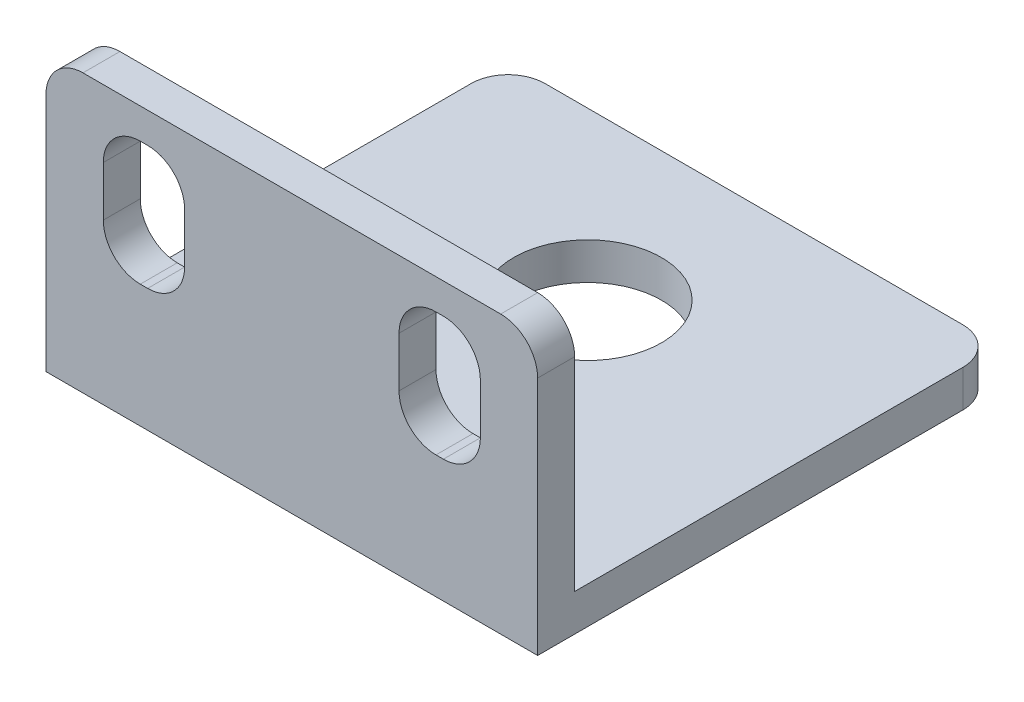
ISO-10303-21;
HEADER;
FILE_DESCRIPTION(('STEP AP214'),'2;1');
FILE_NAME('part.step','',(''),(''),'','','');
FILE_SCHEMA(('AUTOMOTIVE_DESIGN { 1 0 10303 214 1 1 1 1 }'));
ENDSEC;
DATA;
#1=APPLICATION_CONTEXT('core data for automotive mechanical design processes');
#2=APPLICATION_PROTOCOL_DEFINITION('international standard','automotive_design',2000,#1);
#3=PRODUCT_CONTEXT('',#1,'mechanical');
#4=PRODUCT('Part','Part','',(#3));
#5=PRODUCT_RELATED_PRODUCT_CATEGORY('part','',(#4));
#6=PRODUCT_DEFINITION_FORMATION('','',#4);
#7=PRODUCT_DEFINITION_CONTEXT('part definition',#1,'design');
#8=PRODUCT_DEFINITION('design','',#6,#7);
#9=PRODUCT_DEFINITION_SHAPE('','',#8);
#10=(LENGTH_UNIT() NAMED_UNIT(*) SI_UNIT(.MILLI.,.METRE.));
#11=(NAMED_UNIT(*) PLANE_ANGLE_UNIT() SI_UNIT($,.RADIAN.));
#12=(NAMED_UNIT(*) SI_UNIT($,.STERADIAN.) SOLID_ANGLE_UNIT());
#13=UNCERTAINTY_MEASURE_WITH_UNIT(LENGTH_MEASURE(1.E-05),#10,'distance_accuracy_value','');
#14=(GEOMETRIC_REPRESENTATION_CONTEXT(3) GLOBAL_UNCERTAINTY_ASSIGNED_CONTEXT((#13)) GLOBAL_UNIT_ASSIGNED_CONTEXT((#10,
#11,#12)) REPRESENTATION_CONTEXT('',''));
#15=CARTESIAN_POINT('',(0.,0.,0.));
#16=DIRECTION('',(0.,0.,1.));
#17=DIRECTION('',(1.,0.,0.));
#18=AXIS2_PLACEMENT_3D('',#15,#16,#17);
#19=CARTESIAN_POINT('',(-13.3,2.,12.5));
#20=DIRECTION('',(1.,0.,0.));
#21=DIRECTION('',(0.,0.,-1.));
#22=AXIS2_PLACEMENT_3D('',#19,#20,#21);
#23=PLANE('',#22);
#24=DIRECTION('',(0.,0.,1.));
#25=VECTOR('',#24,1.);
#26=CARTESIAN_POINT('',(-13.3,2.,12.5));
#27=LINE('',#26,#25);
#28=CARTESIAN_POINT('',(-13.3,2.,-10.5));
#29=VERTEX_POINT('',#28);
#30=CARTESIAN_POINT('',(-13.3,2.,10.5));
#31=VERTEX_POINT('',#30);
#32=EDGE_CURVE('E209',#29,#31,#27,.T.);
#33=ORIENTED_EDGE('',*,*,#32,.F.);
#34=DIRECTION('',(0.,-1.,0.));
#35=VECTOR('',#34,1.);
#36=CARTESIAN_POINT('',(-13.3,2.,-10.5));
#37=LINE('',#36,#35);
#38=CARTESIAN_POINT('',(-13.3,0.,-10.5));
#39=VERTEX_POINT('',#38);
#40=EDGE_CURVE('E257',#29,#39,#37,.T.);
#41=ORIENTED_EDGE('',*,*,#40,.T.);
#42=DIRECTION('',(0.,0.,1.));
#43=VECTOR('',#42,1.);
#44=CARTESIAN_POINT('',(-13.3,0.,12.5));
#45=LINE('',#44,#43);
#46=CARTESIAN_POINT('',(-13.3,0.,12.5));
#47=VERTEX_POINT('',#46);
#48=EDGE_CURVE('E274',#39,#47,#45,.T.);
#49=ORIENTED_EDGE('',*,*,#48,.T.);
#50=DIRECTION('',(0.,-1.,0.));
#51=VECTOR('',#50,1.);
#52=CARTESIAN_POINT('',(-13.3,2.,12.5));
#53=LINE('',#52,#51);
#54=CARTESIAN_POINT('',(-13.3,13.,12.5));
#55=VERTEX_POINT('',#54);
#56=EDGE_CURVE('E258',#55,#47,#53,.T.);
#57=ORIENTED_EDGE('',*,*,#56,.F.);
#58=DIRECTION('',(0.,0.,1.));
#59=VECTOR('',#58,1.);
#60=CARTESIAN_POINT('',(-13.3,13.,12.5));
#61=LINE('',#60,#59);
#62=CARTESIAN_POINT('',(-13.3,13.,10.5));
#63=VERTEX_POINT('',#62);
#64=EDGE_CURVE('E228',#55,#63,#61,.F.);
#65=ORIENTED_EDGE('',*,*,#64,.T.);
#66=DIRECTION('',(0.,-1.,0.));
#67=VECTOR('',#66,1.);
#68=CARTESIAN_POINT('',(-13.3,15.,10.5));
#69=LINE('',#68,#67);
#70=EDGE_CURVE('E225',#63,#31,#69,.T.);
#71=ORIENTED_EDGE('',*,*,#70,.T.);
#72=EDGE_LOOP('',(#33,#41,#49,#57,#65,#71));
#73=FACE_BOUND('',#72,.T.);
#74=ADVANCED_FACE('F34',(#73),#23,.F.);
#75=CARTESIAN_POINT('',(13.3,2.,12.5));
#76=DIRECTION('',(0.,0.,-1.));
#77=DIRECTION('',(-1.,0.,0.));
#78=AXIS2_PLACEMENT_3D('',#75,#76,#77);
#79=PLANE('',#78);
#80=DIRECTION('',(0.,-1.,0.));
#81=VECTOR('',#80,1.);
#82=CARTESIAN_POINT('',(-5.8,6.65,12.5));
#83=LINE('',#82,#81);
#84=CARTESIAN_POINT('',(-5.8,11.35,12.5));
#85=VERTEX_POINT('',#84);
#86=CARTESIAN_POINT('',(-5.8,8.65,12.5));
#87=VERTEX_POINT('',#86);
#88=EDGE_CURVE('E420',#85,#87,#83,.T.);
#89=ORIENTED_EDGE('',*,*,#88,.T.);
#90=CARTESIAN_POINT('',(-7.8,8.65,12.5));
#91=DIRECTION('',(0.,0.,-1.));
#92=DIRECTION('',(-1.,0.,0.));
#93=AXIS2_PLACEMENT_3D('',#90,#91,#92);
#94=CIRCLE('',#93,2.);
#95=CARTESIAN_POINT('',(-7.8,6.65,12.5));
#96=VERTEX_POINT('',#95);
#97=EDGE_CURVE('E344',#87,#96,#94,.T.);
#98=ORIENTED_EDGE('',*,*,#97,.T.);
#99=DIRECTION('',(-1.,0.,0.));
#100=VECTOR('',#99,1.);
#101=CARTESIAN_POINT('',(-5.8,6.65,12.5));
#102=LINE('',#101,#100);
#103=CARTESIAN_POINT('',(-8.2,6.65,12.5));
#104=VERTEX_POINT('',#103);
#105=EDGE_CURVE('E392',#96,#104,#102,.T.);
#106=ORIENTED_EDGE('',*,*,#105,.T.);
#107=CARTESIAN_POINT('',(-8.2,8.65,12.5));
#108=DIRECTION('',(0.,0.,-1.));
#109=DIRECTION('',(-1.,0.,0.));
#110=AXIS2_PLACEMENT_3D('',#107,#108,#109);
#111=CIRCLE('',#110,2.);
#112=CARTESIAN_POINT('',(-10.2,8.65,12.5));
#113=VERTEX_POINT('',#112);
#114=EDGE_CURVE('E340',#104,#113,#111,.T.);
#115=ORIENTED_EDGE('',*,*,#114,.T.);
#116=DIRECTION('',(0.,1.,0.));
#117=VECTOR('',#116,1.);
#118=CARTESIAN_POINT('',(-10.2,6.65,12.5));
#119=LINE('',#118,#117);
#120=CARTESIAN_POINT('',(-10.2,11.35,12.5));
#121=VERTEX_POINT('',#120);
#122=EDGE_CURVE('E407',#113,#121,#119,.T.);
#123=ORIENTED_EDGE('',*,*,#122,.T.);
#124=CARTESIAN_POINT('',(-8.2,11.35,12.5));
#125=DIRECTION('',(0.,0.,-1.));
#126=DIRECTION('',(-1.,0.,0.));
#127=AXIS2_PLACEMENT_3D('',#124,#125,#126);
#128=CIRCLE('',#127,2.);
#129=CARTESIAN_POINT('',(-8.2,13.35,12.5));
#130=VERTEX_POINT('',#129);
#131=EDGE_CURVE('E348',#121,#130,#128,.T.);
#132=ORIENTED_EDGE('',*,*,#131,.T.);
#133=DIRECTION('',(1.,0.,0.));
#134=VECTOR('',#133,1.);
#135=CARTESIAN_POINT('',(-5.8,13.35,12.5));
#136=LINE('',#135,#134);
#137=CARTESIAN_POINT('',(-7.8,13.35,12.5));
#138=VERTEX_POINT('',#137);
#139=EDGE_CURVE('E423',#130,#138,#136,.T.);
#140=ORIENTED_EDGE('',*,*,#139,.T.);
#141=CARTESIAN_POINT('',(-7.8,11.35,12.5));
#142=DIRECTION('',(0.,0.,-1.));
#143=DIRECTION('',(-1.,0.,0.));
#144=AXIS2_PLACEMENT_3D('',#141,#142,#143);
#145=CIRCLE('',#144,2.);
#146=EDGE_CURVE('E352',#138,#85,#145,.T.);
#147=ORIENTED_EDGE('',*,*,#146,.T.);
#148=EDGE_LOOP('',(#89,#98,#106,#115,#123,#132,#140,#147));
#149=FACE_BOUND('',#148,.T.);
#150=DIRECTION('',(0.,-1.,0.));
#151=VECTOR('',#150,1.);
#152=CARTESIAN_POINT('',(10.2,6.65,12.5));
#153=LINE('',#152,#151);
#154=CARTESIAN_POINT('',(10.2,11.35,12.5));
#155=VERTEX_POINT('',#154);
#156=CARTESIAN_POINT('',(10.2,8.65,12.5));
#157=VERTEX_POINT('',#156);
#158=EDGE_CURVE('E240',#155,#157,#153,.T.);
#159=ORIENTED_EDGE('',*,*,#158,.T.);
#160=CARTESIAN_POINT('',(8.2,8.65,12.5));
#161=DIRECTION('',(0.,0.,-1.));
#162=DIRECTION('',(-1.,0.,0.));
#163=AXIS2_PLACEMENT_3D('',#160,#161,#162);
#164=CIRCLE('',#163,2.);
#165=CARTESIAN_POINT('',(8.2,6.65,12.5));
#166=VERTEX_POINT('',#165);
#167=EDGE_CURVE('E336',#157,#166,#164,.T.);
#168=ORIENTED_EDGE('',*,*,#167,.T.);
#169=DIRECTION('',(-1.,0.,0.));
#170=VECTOR('',#169,1.);
#171=CARTESIAN_POINT('',(10.2,6.65,12.5));
#172=LINE('',#171,#170);
#173=CARTESIAN_POINT('',(7.8,6.65,12.5));
#174=VERTEX_POINT('',#173);
#175=EDGE_CURVE('E235',#166,#174,#172,.T.);
#176=ORIENTED_EDGE('',*,*,#175,.T.);
#177=CARTESIAN_POINT('',(7.8,8.65,12.5));
#178=DIRECTION('',(0.,0.,-1.));
#179=DIRECTION('',(-1.,0.,0.));
#180=AXIS2_PLACEMENT_3D('',#177,#178,#179);
#181=CIRCLE('',#180,2.);
#182=CARTESIAN_POINT('',(5.8,8.65,12.5));
#183=VERTEX_POINT('',#182);
#184=EDGE_CURVE('E332',#174,#183,#181,.T.);
#185=ORIENTED_EDGE('',*,*,#184,.T.);
#186=DIRECTION('',(0.,1.,0.));
#187=VECTOR('',#186,1.);
#188=CARTESIAN_POINT('',(5.8,6.65,12.5));
#189=LINE('',#188,#187);
#190=CARTESIAN_POINT('',(5.8,11.35,12.5));
#191=VERTEX_POINT('',#190);
#192=EDGE_CURVE('E387',#183,#191,#189,.T.);
#193=ORIENTED_EDGE('',*,*,#192,.T.);
#194=CARTESIAN_POINT('',(7.8,11.35,12.5));
#195=DIRECTION('',(0.,0.,-1.));
#196=DIRECTION('',(-1.,0.,0.));
#197=AXIS2_PLACEMENT_3D('',#194,#195,#196);
#198=CIRCLE('',#197,2.);
#199=CARTESIAN_POINT('',(7.8,13.35,12.5));
#200=VERTEX_POINT('',#199);
#201=EDGE_CURVE('E356',#191,#200,#198,.T.);
#202=ORIENTED_EDGE('',*,*,#201,.T.);
#203=DIRECTION('',(1.,0.,0.));
#204=VECTOR('',#203,1.);
#205=CARTESIAN_POINT('',(10.2,13.35,12.5));
#206=LINE('',#205,#204);
#207=CARTESIAN_POINT('',(8.2,13.35,12.5));
#208=VERTEX_POINT('',#207);
#209=EDGE_CURVE('E382',#200,#208,#206,.T.);
#210=ORIENTED_EDGE('',*,*,#209,.T.);
#211=CARTESIAN_POINT('',(8.2,11.35,12.5));
#212=DIRECTION('',(0.,0.,-1.));
#213=DIRECTION('',(-1.,0.,0.));
#214=AXIS2_PLACEMENT_3D('',#211,#212,#213);
#215=CIRCLE('',#214,2.);
#216=EDGE_CURVE('E11',#208,#155,#215,.T.);
#217=ORIENTED_EDGE('',*,*,#216,.T.);
#218=EDGE_LOOP('',(#159,#168,#176,#185,#193,#202,#210,#217));
#219=FACE_BOUND('',#218,.T.);
#220=DIRECTION('',(0.,-1.,0.));
#221=VECTOR('',#220,1.);
#222=CARTESIAN_POINT('',(13.3,2.,12.5));
#223=LINE('',#222,#221);
#224=CARTESIAN_POINT('',(13.3,13.,12.5));
#225=VERTEX_POINT('',#224);
#226=CARTESIAN_POINT('',(13.3,0.,12.5));
#227=VERTEX_POINT('',#226);
#228=EDGE_CURVE('E513',#225,#227,#223,.T.);
#229=ORIENTED_EDGE('',*,*,#228,.F.);
#230=CARTESIAN_POINT('',(11.3,13.,12.5));
#231=DIRECTION('',(0.,0.,-1.));
#232=DIRECTION('',(-1.,0.,0.));
#233=AXIS2_PLACEMENT_3D('',#230,#231,#232);
#234=CIRCLE('',#233,2.);
#235=CARTESIAN_POINT('',(11.3,15.,12.5));
#236=VERTEX_POINT('',#235);
#237=EDGE_CURVE('E328',#225,#236,#234,.F.);
#238=ORIENTED_EDGE('',*,*,#237,.T.);
#239=DIRECTION('',(1.,0.,0.));
#240=VECTOR('',#239,1.);
#241=CARTESIAN_POINT('',(-13.3,15.,12.5));
#242=LINE('',#241,#240);
#243=CARTESIAN_POINT('',(-11.3,15.,12.5));
#244=VERTEX_POINT('',#243);
#245=EDGE_CURVE('E234',#244,#236,#242,.T.);
#246=ORIENTED_EDGE('',*,*,#245,.F.);
#247=CARTESIAN_POINT('',(-11.3,13.,12.5));
#248=DIRECTION('',(0.,0.,-1.));
#249=DIRECTION('',(-1.,0.,0.));
#250=AXIS2_PLACEMENT_3D('',#247,#248,#249);
#251=CIRCLE('',#250,2.);
#252=EDGE_CURVE('E326',#244,#55,#251,.F.);
#253=ORIENTED_EDGE('',*,*,#252,.T.);
#254=ORIENTED_EDGE('',*,*,#56,.T.);
#255=DIRECTION('',(1.,0.,0.));
#256=VECTOR('',#255,1.);
#257=CARTESIAN_POINT('',(13.3,0.,12.5));
#258=LINE('',#257,#256);
#259=EDGE_CURVE('E528',#47,#227,#258,.T.);
#260=ORIENTED_EDGE('',*,*,#259,.T.);
#261=EDGE_LOOP('',(#229,#238,#246,#253,#254,#260));
#262=FACE_BOUND('',#261,.T.);
#263=ADVANCED_FACE('F379',(#149,#219,#262),#79,.F.);
#264=CARTESIAN_POINT('',(13.3,2.,12.5));
#265=DIRECTION('',(-1.,0.,0.));
#266=DIRECTION('',(0.,0.,1.));
#267=AXIS2_PLACEMENT_3D('',#264,#265,#266);
#268=PLANE('',#267);
#269=DIRECTION('',(0.,0.,-1.));
#270=VECTOR('',#269,1.);
#271=CARTESIAN_POINT('',(13.3,0.,12.5));
#272=LINE('',#271,#270);
#273=CARTESIAN_POINT('',(13.3,0.,-10.5));
#274=VERTEX_POINT('',#273);
#275=EDGE_CURVE('E525',#227,#274,#272,.T.);
#276=ORIENTED_EDGE('',*,*,#275,.T.);
#277=DIRECTION('',(0.,-1.,0.));
#278=VECTOR('',#277,1.);
#279=CARTESIAN_POINT('',(13.3,2.,-10.5));
#280=LINE('',#279,#278);
#281=CARTESIAN_POINT('',(13.3,2.,-10.5));
#282=VERTEX_POINT('',#281);
#283=EDGE_CURVE('E277',#274,#282,#280,.F.);
#284=ORIENTED_EDGE('',*,*,#283,.T.);
#285=DIRECTION('',(0.,0.,-1.));
#286=VECTOR('',#285,1.);
#287=CARTESIAN_POINT('',(13.3,2.,12.5));
#288=LINE('',#287,#286);
#289=CARTESIAN_POINT('',(13.3,2.,10.5));
#290=VERTEX_POINT('',#289);
#291=EDGE_CURVE('E222',#290,#282,#288,.T.);
#292=ORIENTED_EDGE('',*,*,#291,.F.);
#293=DIRECTION('',(0.,-1.,0.));
#294=VECTOR('',#293,1.);
#295=CARTESIAN_POINT('',(13.3,15.,10.5));
#296=LINE('',#295,#294);
#297=CARTESIAN_POINT('',(13.3,13.,10.5));
#298=VERTEX_POINT('',#297);
#299=EDGE_CURVE('E229',#298,#290,#296,.T.);
#300=ORIENTED_EDGE('',*,*,#299,.F.);
#301=DIRECTION('',(0.,0.,-1.));
#302=VECTOR('',#301,1.);
#303=CARTESIAN_POINT('',(13.3,13.,12.5));
#304=LINE('',#303,#302);
#305=EDGE_CURVE('E272',#298,#225,#304,.F.);
#306=ORIENTED_EDGE('',*,*,#305,.T.);
#307=ORIENTED_EDGE('',*,*,#228,.T.);
#308=EDGE_LOOP('',(#276,#284,#292,#300,#306,#307));
#309=FACE_BOUND('',#308,.T.);
#310=ADVANCED_FACE('F452',(#309),#268,.F.);
#311=CARTESIAN_POINT('',(13.3,2.,-12.5));
#312=DIRECTION('',(0.,0.,1.));
#313=DIRECTION('',(1.,0.,0.));
#314=AXIS2_PLACEMENT_3D('',#311,#312,#313);
#315=PLANE('',#314);
#316=DIRECTION('',(-1.,0.,0.));
#317=VECTOR('',#316,1.);
#318=CARTESIAN_POINT('',(13.3,0.,-12.5));
#319=LINE('',#318,#317);
#320=CARTESIAN_POINT('',(11.3,0.,-12.5));
#321=VERTEX_POINT('',#320);
#322=CARTESIAN_POINT('',(-11.3,0.,-12.5));
#323=VERTEX_POINT('',#322);
#324=EDGE_CURVE('E223',#321,#323,#319,.T.);
#325=ORIENTED_EDGE('',*,*,#324,.T.);
#326=DIRECTION('',(0.,-1.,0.));
#327=VECTOR('',#326,1.);
#328=CARTESIAN_POINT('',(-11.3,2.,-12.5));
#329=LINE('',#328,#327);
#330=CARTESIAN_POINT('',(-11.3,2.,-12.5));
#331=VERTEX_POINT('',#330);
#332=EDGE_CURVE('E267',#323,#331,#329,.F.);
#333=ORIENTED_EDGE('',*,*,#332,.T.);
#334=DIRECTION('',(-1.,0.,0.));
#335=VECTOR('',#334,1.);
#336=CARTESIAN_POINT('',(13.3,2.,-12.5));
#337=LINE('',#336,#335);
#338=CARTESIAN_POINT('',(11.3,2.,-12.5));
#339=VERTEX_POINT('',#338);
#340=EDGE_CURVE('E520',#339,#331,#337,.T.);
#341=ORIENTED_EDGE('',*,*,#340,.F.);
#342=DIRECTION('',(0.,-1.,0.));
#343=VECTOR('',#342,1.);
#344=CARTESIAN_POINT('',(11.3,2.,-12.5));
#345=LINE('',#344,#343);
#346=EDGE_CURVE('E264',#339,#321,#345,.T.);
#347=ORIENTED_EDGE('',*,*,#346,.T.);
#348=EDGE_LOOP('',(#325,#333,#341,#347));
#349=FACE_BOUND('',#348,.T.);
#350=ADVANCED_FACE('F444',(#349),#315,.F.);
#351=CARTESIAN_POINT('',(-13.3,2.,-12.5));
#352=DIRECTION('',(0.,1.,0.));
#353=DIRECTION('',(0.,0.,1.));
#354=AXIS2_PLACEMENT_3D('',#351,#352,#353);
#355=PLANE('',#354);
#356=CARTESIAN_POINT('',(0.,2.,-3.5));
#357=DIRECTION('',(0.,1.,0.));
#358=DIRECTION('',(0.,0.,1.));
#359=AXIS2_PLACEMENT_3D('',#356,#357,#358);
#360=CIRCLE('',#359,4.);
#361=CARTESIAN_POINT('',(0.,2.,0.499999999999999));
#362=VERTEX_POINT('',#361);
#363=EDGE_CURVE('E428',#362,#362,#360,.T.);
#364=ORIENTED_EDGE('',*,*,#363,.F.);
#365=EDGE_LOOP('',(#364));
#366=FACE_BOUND('',#365,.T.);
#367=ORIENTED_EDGE('',*,*,#340,.T.);
#368=CARTESIAN_POINT('',(-11.3,2.,-10.5));
#369=DIRECTION('',(0.,1.,0.));
#370=DIRECTION('',(0.,0.,1.));
#371=AXIS2_PLACEMENT_3D('',#368,#369,#370);
#372=CIRCLE('',#371,2.);
#373=EDGE_CURVE('E218',#331,#29,#372,.T.);
#374=ORIENTED_EDGE('',*,*,#373,.T.);
#375=ORIENTED_EDGE('',*,*,#32,.T.);
#376=DIRECTION('',(-1.,0.,0.));
#377=VECTOR('',#376,1.);
#378=CARTESIAN_POINT('',(-13.3,2.,10.5));
#379=LINE('',#378,#377);
#380=EDGE_CURVE('E215',#290,#31,#379,.T.);
#381=ORIENTED_EDGE('',*,*,#380,.F.);
#382=ORIENTED_EDGE('',*,*,#291,.T.);
#383=CARTESIAN_POINT('',(11.3,2.,-10.5));
#384=DIRECTION('',(0.,1.,0.));
#385=DIRECTION('',(0.,0.,1.));
#386=AXIS2_PLACEMENT_3D('',#383,#384,#385);
#387=CIRCLE('',#386,2.);
#388=EDGE_CURVE('E269',#282,#339,#387,.T.);
#389=ORIENTED_EDGE('',*,*,#388,.T.);
#390=EDGE_LOOP('',(#367,#374,#375,#381,#382,#389));
#391=FACE_BOUND('',#390,.T.);
#392=ADVANCED_FACE('F212',(#366,#391),#355,.T.);
#393=CARTESIAN_POINT('',(-13.3,0.,-12.5));
#394=DIRECTION('',(0.,1.,0.));
#395=DIRECTION('',(0.,0.,1.));
#396=AXIS2_PLACEMENT_3D('',#393,#394,#395);
#397=PLANE('',#396);
#398=CARTESIAN_POINT('',(0.,0.,-3.5));
#399=DIRECTION('',(0.,1.,0.));
#400=DIRECTION('',(0.,0.,1.));
#401=AXIS2_PLACEMENT_3D('',#398,#399,#400);
#402=CIRCLE('',#401,4.);
#403=CARTESIAN_POINT('',(0.,0.,0.499999999999999));
#404=VERTEX_POINT('',#403);
#405=EDGE_CURVE('E417',#404,#404,#402,.T.);
#406=ORIENTED_EDGE('',*,*,#405,.T.);
#407=EDGE_LOOP('',(#406));
#408=FACE_BOUND('',#407,.T.);
#409=ORIENTED_EDGE('',*,*,#48,.F.);
#410=CARTESIAN_POINT('',(-11.3,0.,-10.5));
#411=DIRECTION('',(0.,1.,0.));
#412=DIRECTION('',(0.,0.,1.));
#413=AXIS2_PLACEMENT_3D('',#410,#411,#412);
#414=CIRCLE('',#413,2.);
#415=EDGE_CURVE('E262',#39,#323,#414,.F.);
#416=ORIENTED_EDGE('',*,*,#415,.T.);
#417=ORIENTED_EDGE('',*,*,#324,.F.);
#418=CARTESIAN_POINT('',(11.3,0.,-10.5));
#419=DIRECTION('',(0.,1.,0.));
#420=DIRECTION('',(0.,0.,1.));
#421=AXIS2_PLACEMENT_3D('',#418,#419,#420);
#422=CIRCLE('',#421,2.);
#423=EDGE_CURVE('E260',#321,#274,#422,.F.);
#424=ORIENTED_EDGE('',*,*,#423,.T.);
#425=ORIENTED_EDGE('',*,*,#275,.F.);
#426=ORIENTED_EDGE('',*,*,#259,.F.);
#427=EDGE_LOOP('',(#409,#416,#417,#424,#425,#426));
#428=FACE_BOUND('',#427,.T.);
#429=ADVANCED_FACE('F434',(#408,#428),#397,.F.);
#430=CARTESIAN_POINT('',(-13.3,15.,10.5));
#431=DIRECTION('',(0.,0.,1.));
#432=DIRECTION('',(1.,0.,0.));
#433=AXIS2_PLACEMENT_3D('',#430,#431,#432);
#434=PLANE('',#433);
#435=DIRECTION('',(1.,0.,0.));
#436=VECTOR('',#435,1.);
#437=CARTESIAN_POINT('',(-5.8,13.35,10.5));
#438=LINE('',#437,#436);
#439=CARTESIAN_POINT('',(-8.2,13.35,10.5));
#440=VERTEX_POINT('',#439);
#441=CARTESIAN_POINT('',(-7.8,13.35,10.5));
#442=VERTEX_POINT('',#441);
#443=EDGE_CURVE('E411',#440,#442,#438,.T.);
#444=ORIENTED_EDGE('',*,*,#443,.F.);
#445=CARTESIAN_POINT('',(-8.2,11.35,10.5));
#446=DIRECTION('',(0.,0.,1.));
#447=DIRECTION('',(1.,0.,0.));
#448=AXIS2_PLACEMENT_3D('',#445,#446,#447);
#449=CIRCLE('',#448,2.);
#450=CARTESIAN_POINT('',(-10.2,11.35,10.5));
#451=VERTEX_POINT('',#450);
#452=EDGE_CURVE('E346',#440,#451,#449,.T.);
#453=ORIENTED_EDGE('',*,*,#452,.T.);
#454=DIRECTION('',(0.,1.,0.));
#455=VECTOR('',#454,1.);
#456=CARTESIAN_POINT('',(-10.2,6.65,10.5));
#457=LINE('',#456,#455);
#458=CARTESIAN_POINT('',(-10.2,8.65,10.5));
#459=VERTEX_POINT('',#458);
#460=EDGE_CURVE('E414',#459,#451,#457,.T.);
#461=ORIENTED_EDGE('',*,*,#460,.F.);
#462=CARTESIAN_POINT('',(-8.2,8.65,10.5));
#463=DIRECTION('',(0.,0.,1.));
#464=DIRECTION('',(1.,0.,0.));
#465=AXIS2_PLACEMENT_3D('',#462,#463,#464);
#466=CIRCLE('',#465,2.);
#467=CARTESIAN_POINT('',(-8.2,6.65,10.5));
#468=VERTEX_POINT('',#467);
#469=EDGE_CURVE('E338',#459,#468,#466,.T.);
#470=ORIENTED_EDGE('',*,*,#469,.T.);
#471=DIRECTION('',(-1.,0.,0.));
#472=VECTOR('',#471,1.);
#473=CARTESIAN_POINT('',(-5.8,6.65,10.5));
#474=LINE('',#473,#472);
#475=CARTESIAN_POINT('',(-7.8,6.65,10.5));
#476=VERTEX_POINT('',#475);
#477=EDGE_CURVE('E404',#476,#468,#474,.T.);
#478=ORIENTED_EDGE('',*,*,#477,.F.);
#479=CARTESIAN_POINT('',(-7.8,8.65,10.5));
#480=DIRECTION('',(0.,0.,1.));
#481=DIRECTION('',(1.,0.,0.));
#482=AXIS2_PLACEMENT_3D('',#479,#480,#481);
#483=CIRCLE('',#482,2.);
#484=CARTESIAN_POINT('',(-5.8,8.65,10.5));
#485=VERTEX_POINT('',#484);
#486=EDGE_CURVE('E342',#476,#485,#483,.T.);
#487=ORIENTED_EDGE('',*,*,#486,.T.);
#488=DIRECTION('',(0.,-1.,0.));
#489=VECTOR('',#488,1.);
#490=CARTESIAN_POINT('',(-5.8,6.65,10.5));
#491=LINE('',#490,#489);
#492=CARTESIAN_POINT('',(-5.8,11.35,10.5));
#493=VERTEX_POINT('',#492);
#494=EDGE_CURVE('E408',#493,#485,#491,.T.);
#495=ORIENTED_EDGE('',*,*,#494,.F.);
#496=CARTESIAN_POINT('',(-7.8,11.35,10.5));
#497=DIRECTION('',(0.,0.,1.));
#498=DIRECTION('',(1.,0.,0.));
#499=AXIS2_PLACEMENT_3D('',#496,#497,#498);
#500=CIRCLE('',#499,2.);
#501=EDGE_CURVE('E350',#493,#442,#500,.T.);
#502=ORIENTED_EDGE('',*,*,#501,.T.);
#503=EDGE_LOOP('',(#444,#453,#461,#470,#478,#487,#495,#502));
#504=FACE_BOUND('',#503,.T.);
#505=DIRECTION('',(1.,0.,0.));
#506=VECTOR('',#505,1.);
#507=CARTESIAN_POINT('',(10.2,13.35,10.5));
#508=LINE('',#507,#506);
#509=CARTESIAN_POINT('',(7.8,13.35,10.5));
#510=VERTEX_POINT('',#509);
#511=CARTESIAN_POINT('',(8.2,13.35,10.5));
#512=VERTEX_POINT('',#511);
#513=EDGE_CURVE('E361',#510,#512,#508,.T.);
#514=ORIENTED_EDGE('',*,*,#513,.F.);
#515=CARTESIAN_POINT('',(7.8,11.35,10.5));
#516=DIRECTION('',(0.,0.,1.));
#517=DIRECTION('',(1.,0.,0.));
#518=AXIS2_PLACEMENT_3D('',#515,#516,#517);
#519=CIRCLE('',#518,2.);
#520=CARTESIAN_POINT('',(5.8,11.35,10.5));
#521=VERTEX_POINT('',#520);
#522=EDGE_CURVE('E354',#510,#521,#519,.T.);
#523=ORIENTED_EDGE('',*,*,#522,.T.);
#524=DIRECTION('',(0.,1.,0.));
#525=VECTOR('',#524,1.);
#526=CARTESIAN_POINT('',(5.8,6.65,10.5));
#527=LINE('',#526,#525);
#528=CARTESIAN_POINT('',(5.8,8.65,10.5));
#529=VERTEX_POINT('',#528);
#530=EDGE_CURVE('E372',#529,#521,#527,.T.);
#531=ORIENTED_EDGE('',*,*,#530,.F.);
#532=CARTESIAN_POINT('',(7.8,8.65,10.5));
#533=DIRECTION('',(0.,0.,1.));
#534=DIRECTION('',(1.,0.,0.));
#535=AXIS2_PLACEMENT_3D('',#532,#533,#534);
#536=CIRCLE('',#535,2.);
#537=CARTESIAN_POINT('',(7.8,6.65,10.5));
#538=VERTEX_POINT('',#537);
#539=EDGE_CURVE('E330',#529,#538,#536,.T.);
#540=ORIENTED_EDGE('',*,*,#539,.T.);
#541=DIRECTION('',(-1.,0.,0.));
#542=VECTOR('',#541,1.);
#543=CARTESIAN_POINT('',(10.2,6.65,10.5));
#544=LINE('',#543,#542);
#545=CARTESIAN_POINT('',(8.2,6.65,10.5));
#546=VERTEX_POINT('',#545);
#547=EDGE_CURVE('E395',#546,#538,#544,.T.);
#548=ORIENTED_EDGE('',*,*,#547,.F.);
#549=CARTESIAN_POINT('',(8.2,8.65,10.5));
#550=DIRECTION('',(0.,0.,1.));
#551=DIRECTION('',(1.,0.,0.));
#552=AXIS2_PLACEMENT_3D('',#549,#550,#551);
#553=CIRCLE('',#552,2.);
#554=CARTESIAN_POINT('',(10.2,8.65,10.5));
#555=VERTEX_POINT('',#554);
#556=EDGE_CURVE('E334',#546,#555,#553,.T.);
#557=ORIENTED_EDGE('',*,*,#556,.T.);
#558=DIRECTION('',(0.,-1.,0.));
#559=VECTOR('',#558,1.);
#560=CARTESIAN_POINT('',(10.2,6.65,10.5));
#561=LINE('',#560,#559);
#562=CARTESIAN_POINT('',(10.2,11.35,10.5));
#563=VERTEX_POINT('',#562);
#564=EDGE_CURVE('E363',#563,#555,#561,.T.);
#565=ORIENTED_EDGE('',*,*,#564,.F.);
#566=CARTESIAN_POINT('',(8.2,11.35,10.5));
#567=DIRECTION('',(0.,0.,1.));
#568=DIRECTION('',(1.,0.,0.));
#569=AXIS2_PLACEMENT_3D('',#566,#567,#568);
#570=CIRCLE('',#569,2.);
#571=EDGE_CURVE('E42',#563,#512,#570,.T.);
#572=ORIENTED_EDGE('',*,*,#571,.T.);
#573=EDGE_LOOP('',(#514,#523,#531,#540,#548,#557,#565,#572));
#574=FACE_BOUND('',#573,.T.);
#575=DIRECTION('',(-1.,0.,0.));
#576=VECTOR('',#575,1.);
#577=CARTESIAN_POINT('',(-13.3,15.,10.5));
#578=LINE('',#577,#576);
#579=CARTESIAN_POINT('',(11.3,15.,10.5));
#580=VERTEX_POINT('',#579);
#581=CARTESIAN_POINT('',(-11.3,15.,10.5));
#582=VERTEX_POINT('',#581);
#583=EDGE_CURVE('E230',#580,#582,#578,.T.);
#584=ORIENTED_EDGE('',*,*,#583,.F.);
#585=CARTESIAN_POINT('',(11.3,13.,10.5));
#586=DIRECTION('',(0.,0.,1.));
#587=DIRECTION('',(1.,0.,0.));
#588=AXIS2_PLACEMENT_3D('',#585,#586,#587);
#589=CIRCLE('',#588,2.);
#590=EDGE_CURVE('E57',#580,#298,#589,.F.);
#591=ORIENTED_EDGE('',*,*,#590,.T.);
#592=ORIENTED_EDGE('',*,*,#299,.T.);
#593=ORIENTED_EDGE('',*,*,#380,.T.);
#594=ORIENTED_EDGE('',*,*,#70,.F.);
#595=CARTESIAN_POINT('',(-11.3,13.,10.5));
#596=DIRECTION('',(0.,0.,1.));
#597=DIRECTION('',(1.,0.,0.));
#598=AXIS2_PLACEMENT_3D('',#595,#596,#597);
#599=CIRCLE('',#598,2.);
#600=EDGE_CURVE('E49',#63,#582,#599,.F.);
#601=ORIENTED_EDGE('',*,*,#600,.T.);
#602=EDGE_LOOP('',(#584,#591,#592,#593,#594,#601));
#603=FACE_BOUND('',#602,.T.);
#604=ADVANCED_FACE('F232',(#504,#574,#603),#434,.F.);
#605=CARTESIAN_POINT('',(-13.3,15.,10.5));
#606=DIRECTION('',(0.,-1.,0.));
#607=DIRECTION('',(0.,0.,-1.));
#608=AXIS2_PLACEMENT_3D('',#605,#606,#607);
#609=PLANE('',#608);
#610=ORIENTED_EDGE('',*,*,#245,.T.);
#611=DIRECTION('',(0.,0.,-1.));
#612=VECTOR('',#611,1.);
#613=CARTESIAN_POINT('',(11.3,15.,10.5));
#614=LINE('',#613,#612);
#615=EDGE_CURVE('E322',#236,#580,#614,.T.);
#616=ORIENTED_EDGE('',*,*,#615,.T.);
#617=ORIENTED_EDGE('',*,*,#583,.T.);
#618=DIRECTION('',(0.,0.,1.));
#619=VECTOR('',#618,1.);
#620=CARTESIAN_POINT('',(-11.3,15.,10.5));
#621=LINE('',#620,#619);
#622=EDGE_CURVE('E319',#582,#244,#621,.T.);
#623=ORIENTED_EDGE('',*,*,#622,.T.);
#624=EDGE_LOOP('',(#610,#616,#617,#623));
#625=FACE_BOUND('',#624,.T.);
#626=ADVANCED_FACE('F515',(#625),#609,.F.);
#627=CARTESIAN_POINT('',(5.8,6.65,12.5));
#628=DIRECTION('',(-1.,0.,0.));
#629=DIRECTION('',(0.,0.,1.));
#630=AXIS2_PLACEMENT_3D('',#627,#628,#629);
#631=PLANE('',#630);
#632=ORIENTED_EDGE('',*,*,#192,.F.);
#633=DIRECTION('',(0.,0.,-1.));
#634=VECTOR('',#633,1.);
#635=CARTESIAN_POINT('',(5.8,8.65,10.5));
#636=LINE('',#635,#634);
#637=EDGE_CURVE('E281',#183,#529,#636,.T.);
#638=ORIENTED_EDGE('',*,*,#637,.T.);
#639=ORIENTED_EDGE('',*,*,#530,.T.);
#640=DIRECTION('',(0.,0.,-1.));
#641=VECTOR('',#640,1.);
#642=CARTESIAN_POINT('',(5.8,11.35,12.5));
#643=LINE('',#642,#641);
#644=EDGE_CURVE('E279',#521,#191,#643,.F.);
#645=ORIENTED_EDGE('',*,*,#644,.T.);
#646=EDGE_LOOP('',(#632,#638,#639,#645));
#647=FACE_BOUND('',#646,.T.);
#648=ADVANCED_FACE('F571',(#647),#631,.F.);
#649=CARTESIAN_POINT('',(10.2,6.65,12.5));
#650=DIRECTION('',(0.,-1.,0.));
#651=DIRECTION('',(0.,0.,-1.));
#652=AXIS2_PLACEMENT_3D('',#649,#650,#651);
#653=PLANE('',#652);
#654=ORIENTED_EDGE('',*,*,#547,.T.);
#655=DIRECTION('',(0.,0.,-1.));
#656=VECTOR('',#655,1.);
#657=CARTESIAN_POINT('',(7.8,6.65,12.5));
#658=LINE('',#657,#656);
#659=EDGE_CURVE('E287',#538,#174,#658,.F.);
#660=ORIENTED_EDGE('',*,*,#659,.T.);
#661=ORIENTED_EDGE('',*,*,#175,.F.);
#662=DIRECTION('',(0.,0.,-1.));
#663=VECTOR('',#662,1.);
#664=CARTESIAN_POINT('',(8.2,6.65,10.5));
#665=LINE('',#664,#663);
#666=EDGE_CURVE('E284',#166,#546,#665,.T.);
#667=ORIENTED_EDGE('',*,*,#666,.T.);
#668=EDGE_LOOP('',(#654,#660,#661,#667));
#669=FACE_BOUND('',#668,.T.);
#670=ADVANCED_FACE('F578',(#669),#653,.F.);
#671=CARTESIAN_POINT('',(10.2,6.65,12.5));
#672=DIRECTION('',(1.,0.,0.));
#673=DIRECTION('',(0.,0.,-1.));
#674=AXIS2_PLACEMENT_3D('',#671,#672,#673);
#675=PLANE('',#674);
#676=ORIENTED_EDGE('',*,*,#564,.T.);
#677=DIRECTION('',(0.,0.,-1.));
#678=VECTOR('',#677,1.);
#679=CARTESIAN_POINT('',(10.2,8.65,12.5));
#680=LINE('',#679,#678);
#681=EDGE_CURVE('E292',#555,#157,#680,.F.);
#682=ORIENTED_EDGE('',*,*,#681,.T.);
#683=ORIENTED_EDGE('',*,*,#158,.F.);
#684=DIRECTION('',(0.,0.,-1.));
#685=VECTOR('',#684,1.);
#686=CARTESIAN_POINT('',(10.2,11.35,10.5));
#687=LINE('',#686,#685);
#688=EDGE_CURVE('E289',#155,#563,#687,.T.);
#689=ORIENTED_EDGE('',*,*,#688,.T.);
#690=EDGE_LOOP('',(#676,#682,#683,#689));
#691=FACE_BOUND('',#690,.T.);
#692=ADVANCED_FACE('F384',(#691),#675,.F.);
#693=CARTESIAN_POINT('',(10.2,13.35,12.5));
#694=DIRECTION('',(0.,1.,0.));
#695=DIRECTION('',(0.,0.,1.));
#696=AXIS2_PLACEMENT_3D('',#693,#694,#695);
#697=PLANE('',#696);
#698=ORIENTED_EDGE('',*,*,#209,.F.);
#699=DIRECTION('',(0.,0.,-1.));
#700=VECTOR('',#699,1.);
#701=CARTESIAN_POINT('',(7.8,13.35,10.5));
#702=LINE('',#701,#700);
#703=EDGE_CURVE('E316',#200,#510,#702,.T.);
#704=ORIENTED_EDGE('',*,*,#703,.T.);
#705=ORIENTED_EDGE('',*,*,#513,.T.);
#706=DIRECTION('',(0.,0.,-1.));
#707=VECTOR('',#706,1.);
#708=CARTESIAN_POINT('',(8.2,13.35,12.5));
#709=LINE('',#708,#707);
#710=EDGE_CURVE('E314',#512,#208,#709,.F.);
#711=ORIENTED_EDGE('',*,*,#710,.T.);
#712=EDGE_LOOP('',(#698,#704,#705,#711));
#713=FACE_BOUND('',#712,.T.);
#714=ADVANCED_FACE('F369',(#713),#697,.F.);
#715=CARTESIAN_POINT('',(-10.2,6.65,12.5));
#716=DIRECTION('',(-1.,0.,0.));
#717=DIRECTION('',(0.,0.,1.));
#718=AXIS2_PLACEMENT_3D('',#715,#716,#717);
#719=PLANE('',#718);
#720=ORIENTED_EDGE('',*,*,#122,.F.);
#721=DIRECTION('',(0.,0.,-1.));
#722=VECTOR('',#721,1.);
#723=CARTESIAN_POINT('',(-10.2,8.65,10.5));
#724=LINE('',#723,#722);
#725=EDGE_CURVE('E296',#113,#459,#724,.T.);
#726=ORIENTED_EDGE('',*,*,#725,.T.);
#727=ORIENTED_EDGE('',*,*,#460,.T.);
#728=DIRECTION('',(0.,0.,-1.));
#729=VECTOR('',#728,1.);
#730=CARTESIAN_POINT('',(-10.2,11.35,12.5));
#731=LINE('',#730,#729);
#732=EDGE_CURVE('E294',#451,#121,#731,.F.);
#733=ORIENTED_EDGE('',*,*,#732,.T.);
#734=EDGE_LOOP('',(#720,#726,#727,#733));
#735=FACE_BOUND('',#734,.T.);
#736=ADVANCED_FACE('F598',(#735),#719,.F.);
#737=CARTESIAN_POINT('',(-5.8,6.65,12.5));
#738=DIRECTION('',(0.,-1.,0.));
#739=DIRECTION('',(0.,0.,-1.));
#740=AXIS2_PLACEMENT_3D('',#737,#738,#739);
#741=PLANE('',#740);
#742=ORIENTED_EDGE('',*,*,#477,.T.);
#743=DIRECTION('',(0.,0.,-1.));
#744=VECTOR('',#743,1.);
#745=CARTESIAN_POINT('',(-8.2,6.65,12.5));
#746=LINE('',#745,#744);
#747=EDGE_CURVE('E302',#468,#104,#746,.F.);
#748=ORIENTED_EDGE('',*,*,#747,.T.);
#749=ORIENTED_EDGE('',*,*,#105,.F.);
#750=DIRECTION('',(0.,0.,-1.));
#751=VECTOR('',#750,1.);
#752=CARTESIAN_POINT('',(-7.8,6.65,10.5));
#753=LINE('',#752,#751);
#754=EDGE_CURVE('E299',#96,#476,#753,.T.);
#755=ORIENTED_EDGE('',*,*,#754,.T.);
#756=EDGE_LOOP('',(#742,#748,#749,#755));
#757=FACE_BOUND('',#756,.T.);
#758=ADVANCED_FACE('F605',(#757),#741,.F.);
#759=CARTESIAN_POINT('',(-5.8,6.65,12.5));
#760=DIRECTION('',(1.,0.,0.));
#761=DIRECTION('',(0.,1.,0.));
#762=AXIS2_PLACEMENT_3D('',#759,#760,#761);
#763=PLANE('',#762);
#764=ORIENTED_EDGE('',*,*,#494,.T.);
#765=DIRECTION('',(0.,0.,-1.));
#766=VECTOR('',#765,1.);
#767=CARTESIAN_POINT('',(-5.8,8.65,12.5));
#768=LINE('',#767,#766);
#769=EDGE_CURVE('E307',#485,#87,#768,.F.);
#770=ORIENTED_EDGE('',*,*,#769,.T.);
#771=ORIENTED_EDGE('',*,*,#88,.F.);
#772=DIRECTION('',(0.,0.,-1.));
#773=VECTOR('',#772,1.);
#774=CARTESIAN_POINT('',(-5.8,11.35,10.5));
#775=LINE('',#774,#773);
#776=EDGE_CURVE('E304',#85,#493,#775,.T.);
#777=ORIENTED_EDGE('',*,*,#776,.T.);
#778=EDGE_LOOP('',(#764,#770,#771,#777));
#779=FACE_BOUND('',#778,.T.);
#780=ADVANCED_FACE('F613',(#779),#763,.F.);
#781=CARTESIAN_POINT('',(-5.8,13.35,12.5));
#782=DIRECTION('',(0.,1.,0.));
#783=DIRECTION('',(0.,0.,1.));
#784=AXIS2_PLACEMENT_3D('',#781,#782,#783);
#785=PLANE('',#784);
#786=ORIENTED_EDGE('',*,*,#139,.F.);
#787=DIRECTION('',(0.,0.,-1.));
#788=VECTOR('',#787,1.);
#789=CARTESIAN_POINT('',(-8.2,13.35,10.5));
#790=LINE('',#789,#788);
#791=EDGE_CURVE('E311',#130,#440,#790,.T.);
#792=ORIENTED_EDGE('',*,*,#791,.T.);
#793=ORIENTED_EDGE('',*,*,#443,.T.);
#794=DIRECTION('',(0.,0.,-1.));
#795=VECTOR('',#794,1.);
#796=CARTESIAN_POINT('',(-7.8,13.35,12.5));
#797=LINE('',#796,#795);
#798=EDGE_CURVE('E309',#442,#138,#797,.F.);
#799=ORIENTED_EDGE('',*,*,#798,.T.);
#800=EDGE_LOOP('',(#786,#792,#793,#799));
#801=FACE_BOUND('',#800,.T.);
#802=ADVANCED_FACE('F469',(#801),#785,.F.);
#803=CARTESIAN_POINT('',(-11.3,2.,-10.5));
#804=DIRECTION('',(0.,-1.,0.));
#805=DIRECTION('',(0.,0.,-1.));
#806=AXIS2_PLACEMENT_3D('',#803,#804,#805);
#807=CYLINDRICAL_SURFACE('',#806,2.);
#808=ORIENTED_EDGE('',*,*,#373,.F.);
#809=ORIENTED_EDGE('',*,*,#332,.F.);
#810=ORIENTED_EDGE('',*,*,#415,.F.);
#811=ORIENTED_EDGE('',*,*,#40,.F.);
#812=EDGE_LOOP('',(#808,#809,#810,#811));
#813=FACE_BOUND('',#812,.T.);
#814=ADVANCED_FACE('F465',(#813),#807,.T.);
#815=CARTESIAN_POINT('',(11.3,2.,-10.5));
#816=DIRECTION('',(0.,-1.,0.));
#817=DIRECTION('',(0.,0.,-1.));
#818=AXIS2_PLACEMENT_3D('',#815,#816,#817);
#819=CYLINDRICAL_SURFACE('',#818,2.);
#820=ORIENTED_EDGE('',*,*,#388,.F.);
#821=ORIENTED_EDGE('',*,*,#283,.F.);
#822=ORIENTED_EDGE('',*,*,#423,.F.);
#823=ORIENTED_EDGE('',*,*,#346,.F.);
#824=EDGE_LOOP('',(#820,#821,#822,#823));
#825=FACE_BOUND('',#824,.T.);
#826=ADVANCED_FACE('F468',(#825),#819,.T.);
#827=CARTESIAN_POINT('',(7.8,8.65,12.5));
#828=DIRECTION('',(0.,0.,1.));
#829=DIRECTION('',(1.,0.,0.));
#830=AXIS2_PLACEMENT_3D('',#827,#828,#829);
#831=CYLINDRICAL_SURFACE('',#830,2.);
#832=ORIENTED_EDGE('',*,*,#184,.F.);
#833=ORIENTED_EDGE('',*,*,#659,.F.);
#834=ORIENTED_EDGE('',*,*,#539,.F.);
#835=ORIENTED_EDGE('',*,*,#637,.F.);
#836=EDGE_LOOP('',(#832,#833,#834,#835));
#837=FACE_BOUND('',#836,.T.);
#838=ADVANCED_FACE('F473',(#837),#831,.F.);
#839=CARTESIAN_POINT('',(8.2,8.65,12.5));
#840=DIRECTION('',(0.,0.,1.));
#841=DIRECTION('',(1.,0.,0.));
#842=AXIS2_PLACEMENT_3D('',#839,#840,#841);
#843=CYLINDRICAL_SURFACE('',#842,2.);
#844=ORIENTED_EDGE('',*,*,#167,.F.);
#845=ORIENTED_EDGE('',*,*,#681,.F.);
#846=ORIENTED_EDGE('',*,*,#556,.F.);
#847=ORIENTED_EDGE('',*,*,#666,.F.);
#848=EDGE_LOOP('',(#844,#845,#846,#847));
#849=FACE_BOUND('',#848,.T.);
#850=ADVANCED_FACE('F477',(#849),#843,.F.);
#851=CARTESIAN_POINT('',(-8.2,8.65,12.5));
#852=DIRECTION('',(0.,0.,1.));
#853=DIRECTION('',(1.,0.,0.));
#854=AXIS2_PLACEMENT_3D('',#851,#852,#853);
#855=CYLINDRICAL_SURFACE('',#854,2.);
#856=ORIENTED_EDGE('',*,*,#114,.F.);
#857=ORIENTED_EDGE('',*,*,#747,.F.);
#858=ORIENTED_EDGE('',*,*,#469,.F.);
#859=ORIENTED_EDGE('',*,*,#725,.F.);
#860=EDGE_LOOP('',(#856,#857,#858,#859));
#861=FACE_BOUND('',#860,.T.);
#862=ADVANCED_FACE('F481',(#861),#855,.F.);
#863=CARTESIAN_POINT('',(-7.8,8.65,12.5));
#864=DIRECTION('',(0.,0.,1.));
#865=DIRECTION('',(1.,0.,0.));
#866=AXIS2_PLACEMENT_3D('',#863,#864,#865);
#867=CYLINDRICAL_SURFACE('',#866,2.);
#868=ORIENTED_EDGE('',*,*,#97,.F.);
#869=ORIENTED_EDGE('',*,*,#769,.F.);
#870=ORIENTED_EDGE('',*,*,#486,.F.);
#871=ORIENTED_EDGE('',*,*,#754,.F.);
#872=EDGE_LOOP('',(#868,#869,#870,#871));
#873=FACE_BOUND('',#872,.T.);
#874=ADVANCED_FACE('F485',(#873),#867,.F.);
#875=CARTESIAN_POINT('',(-8.2,11.35,12.5));
#876=DIRECTION('',(0.,0.,1.));
#877=DIRECTION('',(1.,0.,0.));
#878=AXIS2_PLACEMENT_3D('',#875,#876,#877);
#879=CYLINDRICAL_SURFACE('',#878,2.);
#880=ORIENTED_EDGE('',*,*,#131,.F.);
#881=ORIENTED_EDGE('',*,*,#732,.F.);
#882=ORIENTED_EDGE('',*,*,#452,.F.);
#883=ORIENTED_EDGE('',*,*,#791,.F.);
#884=EDGE_LOOP('',(#880,#881,#882,#883));
#885=FACE_BOUND('',#884,.T.);
#886=ADVANCED_FACE('F489',(#885),#879,.F.);
#887=CARTESIAN_POINT('',(-7.8,11.35,12.5));
#888=DIRECTION('',(0.,0.,1.));
#889=DIRECTION('',(1.,0.,0.));
#890=AXIS2_PLACEMENT_3D('',#887,#888,#889);
#891=CYLINDRICAL_SURFACE('',#890,2.);
#892=ORIENTED_EDGE('',*,*,#146,.F.);
#893=ORIENTED_EDGE('',*,*,#798,.F.);
#894=ORIENTED_EDGE('',*,*,#501,.F.);
#895=ORIENTED_EDGE('',*,*,#776,.F.);
#896=EDGE_LOOP('',(#892,#893,#894,#895));
#897=FACE_BOUND('',#896,.T.);
#898=ADVANCED_FACE('F493',(#897),#891,.F.);
#899=CARTESIAN_POINT('',(7.8,11.35,12.5));
#900=DIRECTION('',(0.,0.,1.));
#901=DIRECTION('',(1.,0.,0.));
#902=AXIS2_PLACEMENT_3D('',#899,#900,#901);
#903=CYLINDRICAL_SURFACE('',#902,2.);
#904=ORIENTED_EDGE('',*,*,#201,.F.);
#905=ORIENTED_EDGE('',*,*,#644,.F.);
#906=ORIENTED_EDGE('',*,*,#522,.F.);
#907=ORIENTED_EDGE('',*,*,#703,.F.);
#908=EDGE_LOOP('',(#904,#905,#906,#907));
#909=FACE_BOUND('',#908,.T.);
#910=ADVANCED_FACE('F497',(#909),#903,.F.);
#911=CARTESIAN_POINT('',(8.2,11.35,12.5));
#912=DIRECTION('',(0.,0.,1.));
#913=DIRECTION('',(1.,0.,0.));
#914=AXIS2_PLACEMENT_3D('',#911,#912,#913);
#915=CYLINDRICAL_SURFACE('',#914,2.);
#916=ORIENTED_EDGE('',*,*,#216,.F.);
#917=ORIENTED_EDGE('',*,*,#710,.F.);
#918=ORIENTED_EDGE('',*,*,#571,.F.);
#919=ORIENTED_EDGE('',*,*,#688,.F.);
#920=EDGE_LOOP('',(#916,#917,#918,#919));
#921=FACE_BOUND('',#920,.T.);
#922=ADVANCED_FACE('F375',(#921),#915,.F.);
#923=CARTESIAN_POINT('',(11.3,13.,10.5));
#924=DIRECTION('',(0.,0.,-1.));
#925=DIRECTION('',(-1.,0.,0.));
#926=AXIS2_PLACEMENT_3D('',#923,#924,#925);
#927=CYLINDRICAL_SURFACE('',#926,2.);
#928=ORIENTED_EDGE('',*,*,#237,.F.);
#929=ORIENTED_EDGE('',*,*,#305,.F.);
#930=ORIENTED_EDGE('',*,*,#590,.F.);
#931=ORIENTED_EDGE('',*,*,#615,.F.);
#932=EDGE_LOOP('',(#928,#929,#930,#931));
#933=FACE_BOUND('',#932,.T.);
#934=ADVANCED_FACE('F503',(#933),#927,.T.);
#935=CARTESIAN_POINT('',(-11.3,13.,10.5));
#936=DIRECTION('',(0.,0.,1.));
#937=DIRECTION('',(1.,0.,0.));
#938=AXIS2_PLACEMENT_3D('',#935,#936,#937);
#939=CYLINDRICAL_SURFACE('',#938,2.);
#940=ORIENTED_EDGE('',*,*,#600,.F.);
#941=ORIENTED_EDGE('',*,*,#64,.F.);
#942=ORIENTED_EDGE('',*,*,#252,.F.);
#943=ORIENTED_EDGE('',*,*,#622,.F.);
#944=EDGE_LOOP('',(#940,#941,#942,#943));
#945=FACE_BOUND('',#944,.T.);
#946=ADVANCED_FACE('F36',(#945),#939,.T.);
#947=CARTESIAN_POINT('',(0.,0.,-3.5));
#948=DIRECTION('',(0.,1.,0.));
#949=DIRECTION('',(0.,0.,1.));
#950=AXIS2_PLACEMENT_3D('',#947,#948,#949);
#951=CYLINDRICAL_SURFACE('',#950,4.);
#952=ORIENTED_EDGE('',*,*,#405,.F.);
#953=EDGE_LOOP('',(#952));
#954=FACE_BOUND('',#953,.T.);
#955=ORIENTED_EDGE('',*,*,#363,.T.);
#956=EDGE_LOOP('',(#955));
#957=FACE_BOUND('',#956,.T.);
#958=ADVANCED_FACE('F437',(#954,#957),#951,.F.);
#959=CLOSED_SHELL('',(#74,#263,#310,#350,#392,#429,#604,#626,#648,#670,#692,#714,#736,#758,#780,
#802,#814,#826,#838,#850,#862,#874,#886,#898,#910,#922,#934,#946,#958));
#960=MANIFOLD_SOLID_BREP('B2',#959);
#961=ADVANCED_BREP_SHAPE_REPRESENTATION('',(#18,#960),#14);
#962=SHAPE_DEFINITION_REPRESENTATION(#9,#961);
ENDSEC;
END-ISO-10303-21;
